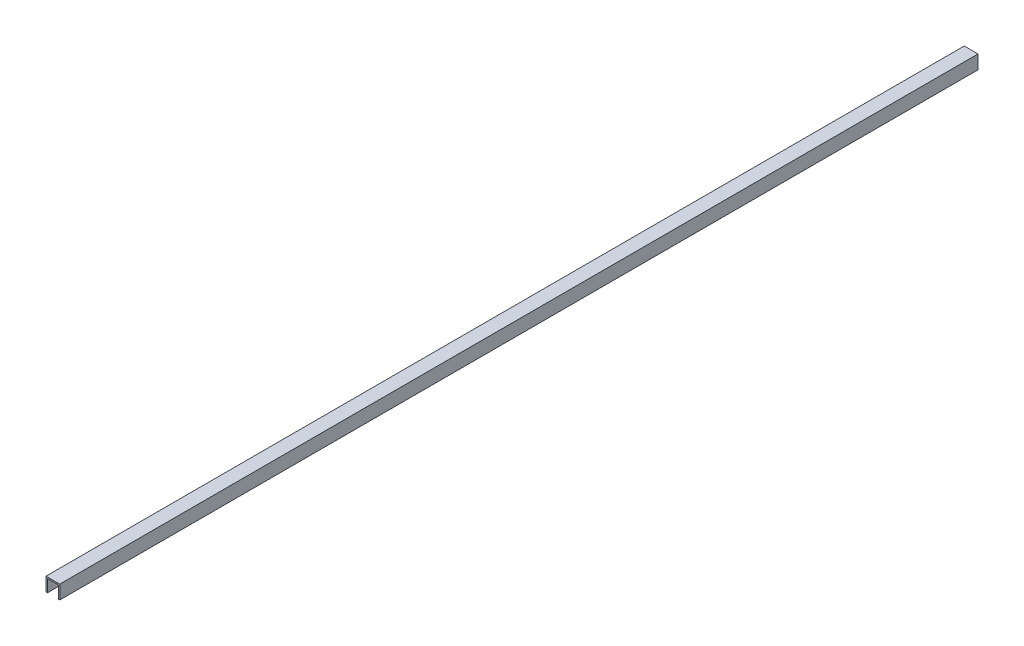
ISO-10303-21;
HEADER;
FILE_DESCRIPTION(('STEP AP214'),'2;1');
FILE_NAME('part.step','',(''),(''),'','','');
FILE_SCHEMA(('AUTOMOTIVE_DESIGN { 1 0 10303 214 1 1 1 1 }'));
ENDSEC;
DATA;
#1=APPLICATION_CONTEXT('core data for automotive mechanical design processes');
#2=APPLICATION_PROTOCOL_DEFINITION('international standard','automotive_design',2000,#1);
#3=PRODUCT_CONTEXT('',#1,'mechanical');
#4=PRODUCT('Part','Part','',(#3));
#5=PRODUCT_RELATED_PRODUCT_CATEGORY('part','',(#4));
#6=PRODUCT_DEFINITION_FORMATION('','',#4);
#7=PRODUCT_DEFINITION_CONTEXT('part definition',#1,'design');
#8=PRODUCT_DEFINITION('design','',#6,#7);
#9=PRODUCT_DEFINITION_SHAPE('','',#8);
#10=(LENGTH_UNIT() NAMED_UNIT(*) SI_UNIT(.MILLI.,.METRE.));
#11=(NAMED_UNIT(*) PLANE_ANGLE_UNIT() SI_UNIT($,.RADIAN.));
#12=(NAMED_UNIT(*) SI_UNIT($,.STERADIAN.) SOLID_ANGLE_UNIT());
#13=UNCERTAINTY_MEASURE_WITH_UNIT(LENGTH_MEASURE(1.E-05),#10,'distance_accuracy_value','');
#14=(GEOMETRIC_REPRESENTATION_CONTEXT(3) GLOBAL_UNCERTAINTY_ASSIGNED_CONTEXT((#13)) GLOBAL_UNIT_ASSIGNED_CONTEXT((#10,
#11,#12)) REPRESENTATION_CONTEXT('',''));
#15=CARTESIAN_POINT('',(0.,0.,0.));
#16=DIRECTION('',(0.,0.,1.));
#17=DIRECTION('',(1.,0.,0.));
#18=AXIS2_PLACEMENT_3D('',#15,#16,#17);
#19=CARTESIAN_POINT('',(-7.5,-7.5,500.));
#20=DIRECTION('',(1.,0.,0.));
#21=DIRECTION('',(0.,1.,0.));
#22=AXIS2_PLACEMENT_3D('',#19,#20,#21);
#23=PLANE('',#22);
#24=DIRECTION('',(0.,-1.,0.));
#25=VECTOR('',#24,1.);
#26=CARTESIAN_POINT('',(-7.5,-7.5,-500.));
#27=LINE('',#26,#25);
#28=CARTESIAN_POINT('',(-7.5,7.5,-500.));
#29=VERTEX_POINT('',#28);
#30=CARTESIAN_POINT('',(-7.5,-7.5,-500.));
#31=VERTEX_POINT('',#30);
#32=EDGE_CURVE('E138',#29,#31,#27,.T.);
#33=ORIENTED_EDGE('',*,*,#32,.T.);
#34=DIRECTION('',(0.,0.,-1.));
#35=VECTOR('',#34,1.);
#36=CARTESIAN_POINT('',(-7.5,-7.5,500.));
#37=LINE('',#36,#35);
#38=CARTESIAN_POINT('',(-7.5,-7.5,500.));
#39=VERTEX_POINT('',#38);
#40=EDGE_CURVE('E11',#39,#31,#37,.T.);
#41=ORIENTED_EDGE('',*,*,#40,.F.);
#42=DIRECTION('',(0.,-1.,0.));
#43=VECTOR('',#42,1.);
#44=CARTESIAN_POINT('',(-7.5,-7.5,500.));
#45=LINE('',#44,#43);
#46=CARTESIAN_POINT('',(-7.5,7.5,500.));
#47=VERTEX_POINT('',#46);
#48=EDGE_CURVE('E152',#47,#39,#45,.T.);
#49=ORIENTED_EDGE('',*,*,#48,.F.);
#50=DIRECTION('',(0.,0.,-1.));
#51=VECTOR('',#50,1.);
#52=CARTESIAN_POINT('',(-7.5,7.5,500.));
#53=LINE('',#52,#51);
#54=EDGE_CURVE('E134',#47,#29,#53,.T.);
#55=ORIENTED_EDGE('',*,*,#54,.T.);
#56=EDGE_LOOP('',(#33,#41,#49,#55));
#57=FACE_BOUND('',#56,.T.);
#58=ADVANCED_FACE('F42',(#57),#23,.F.);
#59=CARTESIAN_POINT('',(-6.,-7.5,500.));
#60=DIRECTION('',(0.,1.,0.));
#61=DIRECTION('',(0.,0.,1.));
#62=AXIS2_PLACEMENT_3D('',#59,#60,#61);
#63=PLANE('',#62);
#64=DIRECTION('',(1.,0.,0.));
#65=VECTOR('',#64,1.);
#66=CARTESIAN_POINT('',(-6.,-7.5,-500.));
#67=LINE('',#66,#65);
#68=CARTESIAN_POINT('',(-6.,-7.5,-500.));
#69=VERTEX_POINT('',#68);
#70=EDGE_CURVE('E141',#31,#69,#67,.T.);
#71=ORIENTED_EDGE('',*,*,#70,.T.);
#72=DIRECTION('',(0.,0.,-1.));
#73=VECTOR('',#72,1.);
#74=CARTESIAN_POINT('',(-6.,-7.5,500.));
#75=LINE('',#74,#73);
#76=CARTESIAN_POINT('',(-6.,-7.5,500.));
#77=VERTEX_POINT('',#76);
#78=EDGE_CURVE('E50',#77,#69,#75,.T.);
#79=ORIENTED_EDGE('',*,*,#78,.F.);
#80=DIRECTION('',(1.,0.,0.));
#81=VECTOR('',#80,1.);
#82=CARTESIAN_POINT('',(-6.,-7.5,500.));
#83=LINE('',#82,#81);
#84=EDGE_CURVE('E101',#39,#77,#83,.T.);
#85=ORIENTED_EDGE('',*,*,#84,.F.);
#86=ORIENTED_EDGE('',*,*,#40,.T.);
#87=EDGE_LOOP('',(#71,#79,#85,#86));
#88=FACE_BOUND('',#87,.T.);
#89=ADVANCED_FACE('F187',(#88),#63,.F.);
#90=CARTESIAN_POINT('',(-6.,-7.5,500.));
#91=DIRECTION('',(-1.,0.,0.));
#92=DIRECTION('',(0.,0.,1.));
#93=AXIS2_PLACEMENT_3D('',#90,#91,#92);
#94=PLANE('',#93);
#95=DIRECTION('',(0.,1.,0.));
#96=VECTOR('',#95,1.);
#97=CARTESIAN_POINT('',(-6.,-7.5,-500.));
#98=LINE('',#97,#96);
#99=CARTESIAN_POINT('',(-6.,6.,-500.));
#100=VERTEX_POINT('',#99);
#101=EDGE_CURVE('E143',#69,#100,#98,.T.);
#102=ORIENTED_EDGE('',*,*,#101,.T.);
#103=DIRECTION('',(0.,0.,-1.));
#104=VECTOR('',#103,1.);
#105=CARTESIAN_POINT('',(-6.,6.,500.));
#106=LINE('',#105,#104);
#107=CARTESIAN_POINT('',(-6.,6.,500.));
#108=VERTEX_POINT('',#107);
#109=EDGE_CURVE('E159',#108,#100,#106,.T.);
#110=ORIENTED_EDGE('',*,*,#109,.F.);
#111=DIRECTION('',(0.,1.,0.));
#112=VECTOR('',#111,1.);
#113=CARTESIAN_POINT('',(-6.,-7.5,500.));
#114=LINE('',#113,#112);
#115=EDGE_CURVE('E167',#77,#108,#114,.T.);
#116=ORIENTED_EDGE('',*,*,#115,.F.);
#117=ORIENTED_EDGE('',*,*,#78,.T.);
#118=EDGE_LOOP('',(#102,#110,#116,#117));
#119=FACE_BOUND('',#118,.T.);
#120=ADVANCED_FACE('F165',(#119),#94,.F.);
#121=CARTESIAN_POINT('',(-6.,6.,500.));
#122=DIRECTION('',(0.,1.,0.));
#123=DIRECTION('',(-1.,0.,0.));
#124=AXIS2_PLACEMENT_3D('',#121,#122,#123);
#125=PLANE('',#124);
#126=DIRECTION('',(1.,0.,0.));
#127=VECTOR('',#126,1.);
#128=CARTESIAN_POINT('',(-6.,6.,-500.));
#129=LINE('',#128,#127);
#130=CARTESIAN_POINT('',(6.,6.,-500.));
#131=VERTEX_POINT('',#130);
#132=EDGE_CURVE('E145',#100,#131,#129,.T.);
#133=ORIENTED_EDGE('',*,*,#132,.T.);
#134=DIRECTION('',(0.,0.,-1.));
#135=VECTOR('',#134,1.);
#136=CARTESIAN_POINT('',(6.,6.,500.));
#137=LINE('',#136,#135);
#138=CARTESIAN_POINT('',(6.,6.,500.));
#139=VERTEX_POINT('',#138);
#140=EDGE_CURVE('E156',#139,#131,#137,.T.);
#141=ORIENTED_EDGE('',*,*,#140,.F.);
#142=DIRECTION('',(1.,0.,0.));
#143=VECTOR('',#142,1.);
#144=CARTESIAN_POINT('',(-6.,6.,500.));
#145=LINE('',#144,#143);
#146=EDGE_CURVE('E179',#108,#139,#145,.T.);
#147=ORIENTED_EDGE('',*,*,#146,.F.);
#148=ORIENTED_EDGE('',*,*,#109,.T.);
#149=EDGE_LOOP('',(#133,#141,#147,#148));
#150=FACE_BOUND('',#149,.T.);
#151=ADVANCED_FACE('F175',(#150),#125,.F.);
#152=CARTESIAN_POINT('',(6.,6.,500.));
#153=DIRECTION('',(1.,0.,0.));
#154=DIRECTION('',(0.,1.,0.));
#155=AXIS2_PLACEMENT_3D('',#152,#153,#154);
#156=PLANE('',#155);
#157=DIRECTION('',(0.,-1.,0.));
#158=VECTOR('',#157,1.);
#159=CARTESIAN_POINT('',(6.,6.,-500.));
#160=LINE('',#159,#158);
#161=CARTESIAN_POINT('',(6.,-7.5,-500.));
#162=VERTEX_POINT('',#161);
#163=EDGE_CURVE('E147',#131,#162,#160,.T.);
#164=ORIENTED_EDGE('',*,*,#163,.T.);
#165=DIRECTION('',(0.,0.,-1.));
#166=VECTOR('',#165,1.);
#167=CARTESIAN_POINT('',(6.,-7.5,500.));
#168=LINE('',#167,#166);
#169=CARTESIAN_POINT('',(6.,-7.5,500.));
#170=VERTEX_POINT('',#169);
#171=EDGE_CURVE('E129',#170,#162,#168,.T.);
#172=ORIENTED_EDGE('',*,*,#171,.F.);
#173=DIRECTION('',(0.,-1.,0.));
#174=VECTOR('',#173,1.);
#175=CARTESIAN_POINT('',(6.,6.,500.));
#176=LINE('',#175,#174);
#177=EDGE_CURVE('E120',#139,#170,#176,.T.);
#178=ORIENTED_EDGE('',*,*,#177,.F.);
#179=ORIENTED_EDGE('',*,*,#140,.T.);
#180=EDGE_LOOP('',(#164,#172,#178,#179));
#181=FACE_BOUND('',#180,.T.);
#182=ADVANCED_FACE('F178',(#181),#156,.F.);
#183=CARTESIAN_POINT('',(7.5,-7.5,500.));
#184=DIRECTION('',(0.,1.,0.));
#185=DIRECTION('',(0.,0.,1.));
#186=AXIS2_PLACEMENT_3D('',#183,#184,#185);
#187=PLANE('',#186);
#188=DIRECTION('',(1.,0.,0.));
#189=VECTOR('',#188,1.);
#190=CARTESIAN_POINT('',(7.5,-7.5,-500.));
#191=LINE('',#190,#189);
#192=CARTESIAN_POINT('',(7.5,-7.5,-500.));
#193=VERTEX_POINT('',#192);
#194=EDGE_CURVE('E128',#162,#193,#191,.T.);
#195=ORIENTED_EDGE('',*,*,#194,.T.);
#196=DIRECTION('',(0.,0.,-1.));
#197=VECTOR('',#196,1.);
#198=CARTESIAN_POINT('',(7.5,-7.5,500.));
#199=LINE('',#198,#197);
#200=CARTESIAN_POINT('',(7.5,-7.5,500.));
#201=VERTEX_POINT('',#200);
#202=EDGE_CURVE('E125',#201,#193,#199,.T.);
#203=ORIENTED_EDGE('',*,*,#202,.F.);
#204=DIRECTION('',(1.,0.,0.));
#205=VECTOR('',#204,1.);
#206=CARTESIAN_POINT('',(7.5,-7.5,500.));
#207=LINE('',#206,#205);
#208=EDGE_CURVE('E114',#170,#201,#207,.T.);
#209=ORIENTED_EDGE('',*,*,#208,.F.);
#210=ORIENTED_EDGE('',*,*,#171,.T.);
#211=EDGE_LOOP('',(#195,#203,#209,#210));
#212=FACE_BOUND('',#211,.T.);
#213=ADVANCED_FACE('F126',(#212),#187,.F.);
#214=CARTESIAN_POINT('',(7.5,-7.5,500.));
#215=DIRECTION('',(-1.,0.,0.));
#216=DIRECTION('',(0.,0.,1.));
#217=AXIS2_PLACEMENT_3D('',#214,#215,#216);
#218=PLANE('',#217);
#219=DIRECTION('',(0.,1.,0.));
#220=VECTOR('',#219,1.);
#221=CARTESIAN_POINT('',(7.5,-7.5,-500.));
#222=LINE('',#221,#220);
#223=CARTESIAN_POINT('',(7.5,7.5,-500.));
#224=VERTEX_POINT('',#223);
#225=EDGE_CURVE('E87',#193,#224,#222,.T.);
#226=ORIENTED_EDGE('',*,*,#225,.T.);
#227=DIRECTION('',(0.,0.,-1.));
#228=VECTOR('',#227,1.);
#229=CARTESIAN_POINT('',(7.5,7.5,500.));
#230=LINE('',#229,#228);
#231=CARTESIAN_POINT('',(7.5,7.5,500.));
#232=VERTEX_POINT('',#231);
#233=EDGE_CURVE('E130',#232,#224,#230,.T.);
#234=ORIENTED_EDGE('',*,*,#233,.F.);
#235=DIRECTION('',(0.,1.,0.));
#236=VECTOR('',#235,1.);
#237=CARTESIAN_POINT('',(7.5,-7.5,500.));
#238=LINE('',#237,#236);
#239=EDGE_CURVE('E118',#201,#232,#238,.T.);
#240=ORIENTED_EDGE('',*,*,#239,.F.);
#241=ORIENTED_EDGE('',*,*,#202,.T.);
#242=EDGE_LOOP('',(#226,#234,#240,#241));
#243=FACE_BOUND('',#242,.T.);
#244=ADVANCED_FACE('F132',(#243),#218,.F.);
#245=CARTESIAN_POINT('',(7.5,7.5,500.));
#246=DIRECTION('',(0.,-1.,0.));
#247=DIRECTION('',(1.,0.,0.));
#248=AXIS2_PLACEMENT_3D('',#245,#246,#247);
#249=PLANE('',#248);
#250=DIRECTION('',(-1.,0.,0.));
#251=VECTOR('',#250,1.);
#252=CARTESIAN_POINT('',(7.5,7.5,-500.));
#253=LINE('',#252,#251);
#254=EDGE_CURVE('E93',#224,#29,#253,.T.);
#255=ORIENTED_EDGE('',*,*,#254,.T.);
#256=ORIENTED_EDGE('',*,*,#54,.F.);
#257=DIRECTION('',(-1.,0.,0.));
#258=VECTOR('',#257,1.);
#259=CARTESIAN_POINT('',(7.5,7.5,500.));
#260=LINE('',#259,#258);
#261=EDGE_CURVE('E58',#232,#47,#260,.T.);
#262=ORIENTED_EDGE('',*,*,#261,.F.);
#263=ORIENTED_EDGE('',*,*,#233,.T.);
#264=EDGE_LOOP('',(#255,#256,#262,#263));
#265=FACE_BOUND('',#264,.T.);
#266=ADVANCED_FACE('F203',(#265),#249,.F.);
#267=CARTESIAN_POINT('',(0.,0.,500.));
#268=DIRECTION('',(0.,0.,1.));
#269=DIRECTION('',(1.,0.,0.));
#270=AXIS2_PLACEMENT_3D('',#267,#268,#269);
#271=PLANE('',#270);
#272=ORIENTED_EDGE('',*,*,#48,.T.);
#273=ORIENTED_EDGE('',*,*,#84,.T.);
#274=ORIENTED_EDGE('',*,*,#115,.T.);
#275=ORIENTED_EDGE('',*,*,#146,.T.);
#276=ORIENTED_EDGE('',*,*,#177,.T.);
#277=ORIENTED_EDGE('',*,*,#208,.T.);
#278=ORIENTED_EDGE('',*,*,#239,.T.);
#279=ORIENTED_EDGE('',*,*,#261,.T.);
#280=EDGE_LOOP('',(#272,#273,#274,#275,#276,#277,#278,#279));
#281=FACE_BOUND('',#280,.T.);
#282=ADVANCED_FACE('F116',(#281),#271,.T.);
#283=CARTESIAN_POINT('',(0.,0.,-500.));
#284=DIRECTION('',(0.,0.,1.));
#285=DIRECTION('',(1.,0.,0.));
#286=AXIS2_PLACEMENT_3D('',#283,#284,#285);
#287=PLANE('',#286);
#288=ORIENTED_EDGE('',*,*,#32,.F.);
#289=ORIENTED_EDGE('',*,*,#254,.F.);
#290=ORIENTED_EDGE('',*,*,#225,.F.);
#291=ORIENTED_EDGE('',*,*,#194,.F.);
#292=ORIENTED_EDGE('',*,*,#163,.F.);
#293=ORIENTED_EDGE('',*,*,#132,.F.);
#294=ORIENTED_EDGE('',*,*,#101,.F.);
#295=ORIENTED_EDGE('',*,*,#70,.F.);
#296=EDGE_LOOP('',(#288,#289,#290,#291,#292,#293,#294,#295));
#297=FACE_BOUND('',#296,.T.);
#298=ADVANCED_FACE('F171',(#297),#287,.F.);
#299=CLOSED_SHELL('',(#58,#89,#120,#151,#182,#213,#244,#266,#282,#298));
#300=MANIFOLD_SOLID_BREP('B2',#299);
#301=ADVANCED_BREP_SHAPE_REPRESENTATION('',(#18,#300),#14);
#302=SHAPE_DEFINITION_REPRESENTATION(#9,#301);
ENDSEC;
END-ISO-10303-21;
